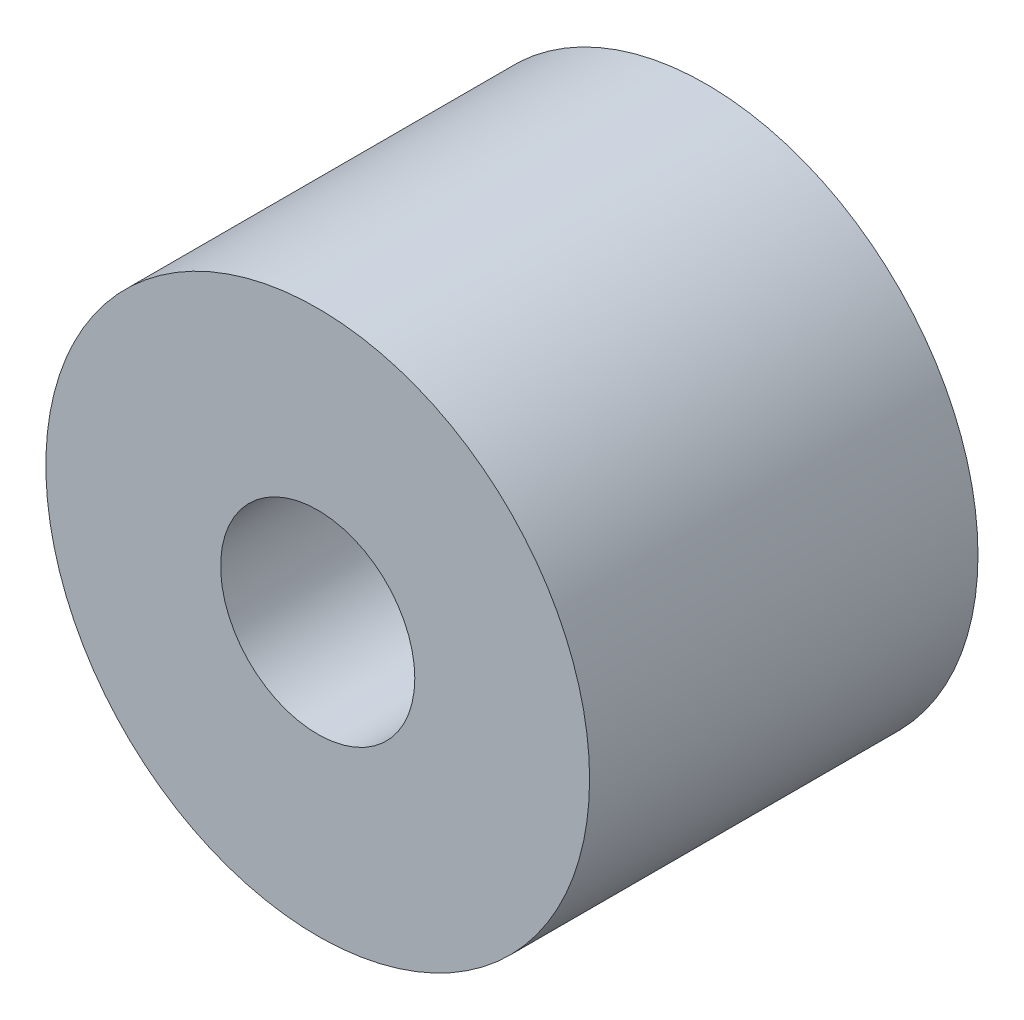
ISO-10303-21;
HEADER;
FILE_DESCRIPTION(('STEP AP214'),'2;1');
FILE_NAME('part.step','',(''),(''),'','','');
FILE_SCHEMA(('AUTOMOTIVE_DESIGN { 1 0 10303 214 1 1 1 1 }'));
ENDSEC;
DATA;
#1=APPLICATION_CONTEXT('core data for automotive mechanical design processes');
#2=APPLICATION_PROTOCOL_DEFINITION('international standard','automotive_design',2000,#1);
#3=PRODUCT_CONTEXT('',#1,'mechanical');
#4=PRODUCT('Part','Part','',(#3));
#5=PRODUCT_RELATED_PRODUCT_CATEGORY('part','',(#4));
#6=PRODUCT_DEFINITION_FORMATION('','',#4);
#7=PRODUCT_DEFINITION_CONTEXT('part definition',#1,'design');
#8=PRODUCT_DEFINITION('design','',#6,#7);
#9=PRODUCT_DEFINITION_SHAPE('','',#8);
#10=(LENGTH_UNIT() NAMED_UNIT(*) SI_UNIT(.MILLI.,.METRE.));
#11=(NAMED_UNIT(*) PLANE_ANGLE_UNIT() SI_UNIT($,.RADIAN.));
#12=(NAMED_UNIT(*) SI_UNIT($,.STERADIAN.) SOLID_ANGLE_UNIT());
#13=UNCERTAINTY_MEASURE_WITH_UNIT(LENGTH_MEASURE(1.E-05),#10,'distance_accuracy_value','');
#14=(GEOMETRIC_REPRESENTATION_CONTEXT(3) GLOBAL_UNCERTAINTY_ASSIGNED_CONTEXT((#13)) GLOBAL_UNIT_ASSIGNED_CONTEXT((#10,
#11,#12)) REPRESENTATION_CONTEXT('',''));
#15=CARTESIAN_POINT('',(0.,0.,0.));
#16=DIRECTION('',(0.,0.,1.));
#17=DIRECTION('',(1.,0.,0.));
#18=AXIS2_PLACEMENT_3D('',#15,#16,#17);
#19=CARTESIAN_POINT('',(0.,0.,5.));
#20=DIRECTION('',(0.,0.,1.));
#21=DIRECTION('',(1.,0.,0.));
#22=AXIS2_PLACEMENT_3D('',#19,#20,#21);
#23=PLANE('',#22);
#24=CARTESIAN_POINT('',(0.,0.,5.));
#25=DIRECTION('',(0.,0.,1.));
#26=DIRECTION('',(1.,0.,0.));
#27=AXIS2_PLACEMENT_3D('',#24,#25,#26);
#28=CIRCLE('',#27,3.5);
#29=CARTESIAN_POINT('',(3.5,0.,5.));
#30=VERTEX_POINT('',#29);
#31=EDGE_CURVE('E10',#30,#30,#28,.T.);
#32=ORIENTED_EDGE('',*,*,#31,.T.);
#33=EDGE_LOOP('',(#32));
#34=FACE_BOUND('',#33,.T.);
#35=CARTESIAN_POINT('',(0.,0.,5.));
#36=DIRECTION('',(0.,0.,1.));
#37=DIRECTION('',(1.,0.,0.));
#38=AXIS2_PLACEMENT_3D('',#35,#36,#37);
#39=CIRCLE('',#38,1.25);
#40=CARTESIAN_POINT('',(1.25,0.,5.));
#41=VERTEX_POINT('',#40);
#42=EDGE_CURVE('E45',#41,#41,#39,.T.);
#43=ORIENTED_EDGE('',*,*,#42,.F.);
#44=EDGE_LOOP('',(#43));
#45=FACE_BOUND('',#44,.T.);
#46=ADVANCED_FACE('F34',(#34,#45),#23,.T.);
#47=CARTESIAN_POINT('',(0.,0.,0.));
#48=DIRECTION('',(0.,0.,1.));
#49=DIRECTION('',(1.,0.,0.));
#50=AXIS2_PLACEMENT_3D('',#47,#48,#49);
#51=PLANE('',#50);
#52=CARTESIAN_POINT('',(0.,0.,0.));
#53=DIRECTION('',(0.,0.,1.));
#54=DIRECTION('',(1.,0.,0.));
#55=AXIS2_PLACEMENT_3D('',#52,#53,#54);
#56=CIRCLE('',#55,3.5);
#57=CARTESIAN_POINT('',(3.5,0.,0.));
#58=VERTEX_POINT('',#57);
#59=EDGE_CURVE('E38',#58,#58,#56,.T.);
#60=ORIENTED_EDGE('',*,*,#59,.F.);
#61=EDGE_LOOP('',(#60));
#62=FACE_BOUND('',#61,.T.);
#63=CARTESIAN_POINT('',(0.,0.,0.));
#64=DIRECTION('',(0.,0.,1.));
#65=DIRECTION('',(1.,0.,0.));
#66=AXIS2_PLACEMENT_3D('',#63,#64,#65);
#67=CIRCLE('',#66,1.25);
#68=CARTESIAN_POINT('',(1.25,0.,0.));
#69=VERTEX_POINT('',#68);
#70=EDGE_CURVE('E47',#69,#69,#67,.T.);
#71=ORIENTED_EDGE('',*,*,#70,.T.);
#72=EDGE_LOOP('',(#71));
#73=FACE_BOUND('',#72,.T.);
#74=ADVANCED_FACE('F57',(#62,#73),#51,.F.);
#75=CARTESIAN_POINT('',(0.,0.,5.));
#76=DIRECTION('',(0.,0.,-1.));
#77=DIRECTION('',(-1.,0.,0.));
#78=AXIS2_PLACEMENT_3D('',#75,#76,#77);
#79=CYLINDRICAL_SURFACE('',#78,3.5);
#80=ORIENTED_EDGE('',*,*,#31,.F.);
#81=EDGE_LOOP('',(#80));
#82=FACE_BOUND('',#81,.T.);
#83=ORIENTED_EDGE('',*,*,#59,.T.);
#84=EDGE_LOOP('',(#83));
#85=FACE_BOUND('',#84,.T.);
#86=ADVANCED_FACE('F36',(#82,#85),#79,.T.);
#87=CARTESIAN_POINT('',(0.,0.,5.));
#88=DIRECTION('',(0.,0.,-1.));
#89=DIRECTION('',(-1.,0.,0.));
#90=AXIS2_PLACEMENT_3D('',#87,#88,#89);
#91=CYLINDRICAL_SURFACE('',#90,1.25);
#92=ORIENTED_EDGE('',*,*,#42,.T.);
#93=EDGE_LOOP('',(#92));
#94=FACE_BOUND('',#93,.T.);
#95=ORIENTED_EDGE('',*,*,#70,.F.);
#96=EDGE_LOOP('',(#95));
#97=FACE_BOUND('',#96,.T.);
#98=ADVANCED_FACE('F53',(#94,#97),#91,.F.);
#99=CLOSED_SHELL('',(#46,#74,#86,#98));
#100=MANIFOLD_SOLID_BREP('B2',#99);
#101=ADVANCED_BREP_SHAPE_REPRESENTATION('',(#18,#100),#14);
#102=SHAPE_DEFINITION_REPRESENTATION(#9,#101);
ENDSEC;
END-ISO-10303-21;
